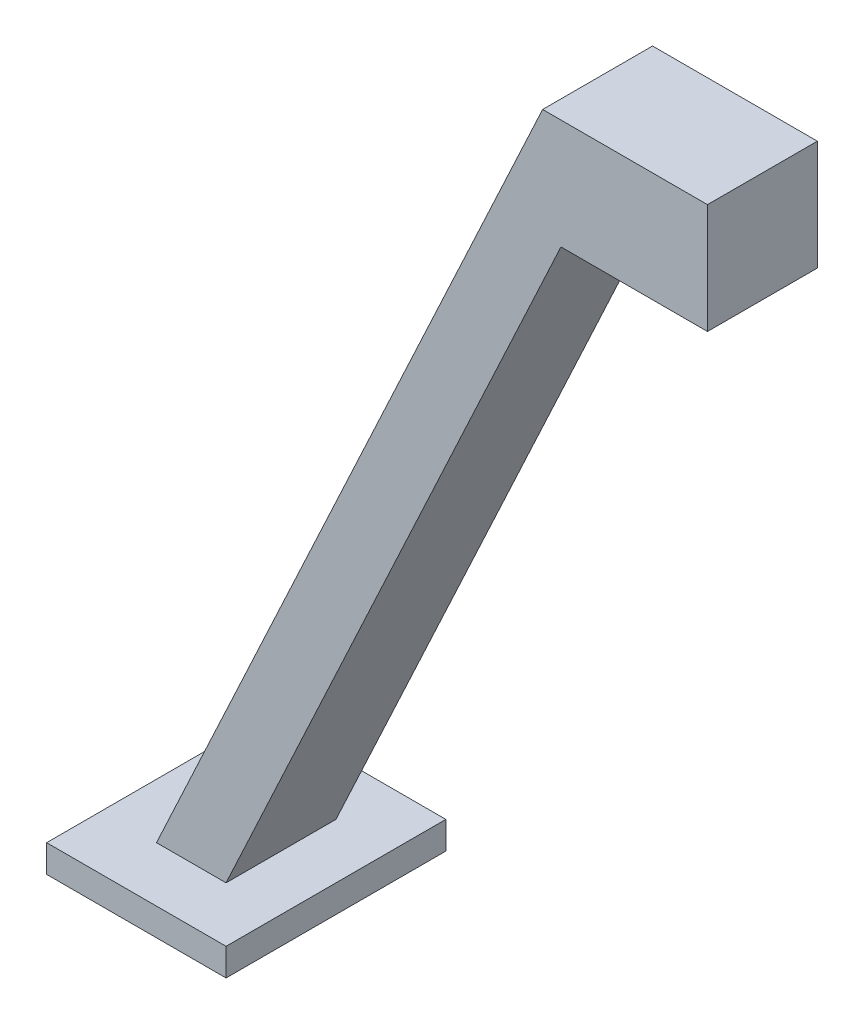
ISO-10303-21;
HEADER;
FILE_DESCRIPTION(('STEP AP214'),'2;1');
FILE_NAME('part.step','',(''),(''),'','','');
FILE_SCHEMA(('AUTOMOTIVE_DESIGN { 1 0 10303 214 1 1 1 1 }'));
ENDSEC;
DATA;
#1=APPLICATION_CONTEXT('core data for automotive mechanical design processes');
#2=APPLICATION_PROTOCOL_DEFINITION('international standard','automotive_design',2000,#1);
#3=PRODUCT_CONTEXT('',#1,'mechanical');
#4=PRODUCT('Part','Part','',(#3));
#5=PRODUCT_RELATED_PRODUCT_CATEGORY('part','',(#4));
#6=PRODUCT_DEFINITION_FORMATION('','',#4);
#7=PRODUCT_DEFINITION_CONTEXT('part definition',#1,'design');
#8=PRODUCT_DEFINITION('design','',#6,#7);
#9=PRODUCT_DEFINITION_SHAPE('','',#8);
#10=(LENGTH_UNIT() NAMED_UNIT(*) SI_UNIT(.MILLI.,.METRE.));
#11=(NAMED_UNIT(*) PLANE_ANGLE_UNIT() SI_UNIT($,.RADIAN.));
#12=(NAMED_UNIT(*) SI_UNIT($,.STERADIAN.) SOLID_ANGLE_UNIT());
#13=UNCERTAINTY_MEASURE_WITH_UNIT(LENGTH_MEASURE(1.E-05),#10,'distance_accuracy_value','');
#14=(GEOMETRIC_REPRESENTATION_CONTEXT(3) GLOBAL_UNCERTAINTY_ASSIGNED_CONTEXT((#13)) GLOBAL_UNIT_ASSIGNED_CONTEXT((#10,
#11,#12)) REPRESENTATION_CONTEXT('',''));
#15=CARTESIAN_POINT('',(0.,0.,0.));
#16=DIRECTION('',(0.,0.,1.));
#17=DIRECTION('',(1.,0.,0.));
#18=AXIS2_PLACEMENT_3D('',#15,#16,#17);
#19=CARTESIAN_POINT('',(-85.2725640839578,-140.7,20.));
#20=DIRECTION('',(0.906307787036651,-0.422618261740697,0.));
#21=DIRECTION('',(0.422618261740697,0.906307787036651,0.));
#22=AXIS2_PLACEMENT_3D('',#19,#20,#21);
#23=PLANE('',#22);
#24=DIRECTION('',(-0.422618261740697,-0.906307787036651,0.));
#25=VECTOR('',#24,1.);
#26=CARTESIAN_POINT('',(-85.2725640839578,-140.7,0.));
#27=LINE('',#26,#25);
#28=CARTESIAN_POINT('',(-15.,10.,0.));
#29=VERTEX_POINT('',#28);
#30=CARTESIAN_POINT('',(-85.2725640839578,-140.7,0.));
#31=VERTEX_POINT('',#30);
#32=EDGE_CURVE('E118',#29,#31,#27,.T.);
#33=ORIENTED_EDGE('',*,*,#32,.T.);
#34=DIRECTION('',(0.,0.,-1.));
#35=VECTOR('',#34,1.);
#36=CARTESIAN_POINT('',(-85.2725640839578,-140.7,20.));
#37=LINE('',#36,#35);
#38=CARTESIAN_POINT('',(-85.2725640839578,-140.7,20.));
#39=VERTEX_POINT('',#38);
#40=EDGE_CURVE('E11',#39,#31,#37,.T.);
#41=ORIENTED_EDGE('',*,*,#40,.F.);
#42=DIRECTION('',(-0.422618261740697,-0.906307787036651,0.));
#43=VECTOR('',#42,1.);
#44=CARTESIAN_POINT('',(-85.2725640839578,-140.7,20.));
#45=LINE('',#44,#43);
#46=CARTESIAN_POINT('',(-15.,10.,20.));
#47=VERTEX_POINT('',#46);
#48=EDGE_CURVE('E84',#47,#39,#45,.T.);
#49=ORIENTED_EDGE('',*,*,#48,.F.);
#50=DIRECTION('',(0.,0.,-1.));
#51=VECTOR('',#50,1.);
#52=CARTESIAN_POINT('',(-15.,10.,20.));
#53=LINE('',#52,#51);
#54=EDGE_CURVE('E114',#47,#29,#53,.T.);
#55=ORIENTED_EDGE('',*,*,#54,.T.);
#56=EDGE_LOOP('',(#33,#41,#49,#55));
#57=FACE_BOUND('',#56,.T.);
#58=ADVANCED_FACE('F35',(#57),#23,.F.);
#59=CARTESIAN_POINT('',(-11.6681995116164,-10.,20.));
#60=DIRECTION('',(-0.906307787036651,0.422618261740697,0.));
#61=DIRECTION('',(-0.422618261740697,-0.906307787036651,0.));
#62=AXIS2_PLACEMENT_3D('',#59,#60,#61);
#63=PLANE('',#62);
#64=DIRECTION('',(0.422618261740697,0.906307787036651,0.));
#65=VECTOR('',#64,1.);
#66=CARTESIAN_POINT('',(-11.6681995116164,-10.,0.));
#67=LINE('',#66,#65);
#68=CARTESIAN_POINT('',(-72.6146104324744,-140.7,0.));
#69=VERTEX_POINT('',#68);
#70=CARTESIAN_POINT('',(-11.6681995116164,-10.,0.));
#71=VERTEX_POINT('',#70);
#72=EDGE_CURVE('E125',#69,#71,#67,.T.);
#73=ORIENTED_EDGE('',*,*,#72,.T.);
#74=DIRECTION('',(0.,0.,-1.));
#75=VECTOR('',#74,1.);
#76=CARTESIAN_POINT('',(-11.6681995116164,-10.,20.));
#77=LINE('',#76,#75);
#78=CARTESIAN_POINT('',(-11.6681995116164,-10.,20.));
#79=VERTEX_POINT('',#78);
#80=EDGE_CURVE('E109',#79,#71,#77,.T.);
#81=ORIENTED_EDGE('',*,*,#80,.F.);
#82=DIRECTION('',(0.422618261740697,0.906307787036651,0.));
#83=VECTOR('',#82,1.);
#84=CARTESIAN_POINT('',(-11.6681995116164,-10.,20.));
#85=LINE('',#84,#83);
#86=CARTESIAN_POINT('',(-72.6146104324744,-140.7,20.));
#87=VERTEX_POINT('',#86);
#88=EDGE_CURVE('E100',#87,#79,#85,.T.);
#89=ORIENTED_EDGE('',*,*,#88,.F.);
#90=DIRECTION('',(0.,0.,-1.));
#91=VECTOR('',#90,1.);
#92=CARTESIAN_POINT('',(-72.6146104324744,-140.7,20.));
#93=LINE('',#92,#91);
#94=EDGE_CURVE('E43',#87,#69,#93,.T.);
#95=ORIENTED_EDGE('',*,*,#94,.T.);
#96=EDGE_LOOP('',(#73,#81,#89,#95));
#97=FACE_BOUND('',#96,.T.);
#98=ADVANCED_FACE('F135',(#97),#63,.F.);
#99=CARTESIAN_POINT('',(15.,-10.,20.));
#100=DIRECTION('',(0.,1.,0.));
#101=DIRECTION('',(-1.,0.,0.));
#102=AXIS2_PLACEMENT_3D('',#99,#100,#101);
#103=PLANE('',#102);
#104=CARTESIAN_POINT('',(4.73695734461899,-10.,9.1808004689824));
#105=DIRECTION('',(0.,-1.,0.));
#106=DIRECTION('',(1.,0.,0.));
#107=AXIS2_PLACEMENT_3D('',#104,#105,#106);
#108=CIRCLE('',#107,2.5);
#109=CARTESIAN_POINT('',(7.23695734461899,-10.,9.1808004689824));
#110=VERTEX_POINT('',#109);
#111=EDGE_CURVE('E169',#110,#110,#108,.T.);
#112=ORIENTED_EDGE('',*,*,#111,.F.);
#113=EDGE_LOOP('',(#112));
#114=FACE_BOUND('',#113,.T.);
#115=DIRECTION('',(1.,0.,0.));
#116=VECTOR('',#115,1.);
#117=CARTESIAN_POINT('',(15.,-10.,0.));
#118=LINE('',#117,#116);
#119=CARTESIAN_POINT('',(15.,-10.,0.));
#120=VERTEX_POINT('',#119);
#121=EDGE_CURVE('E108',#71,#120,#118,.T.);
#122=ORIENTED_EDGE('',*,*,#121,.T.);
#123=DIRECTION('',(0.,0.,-1.));
#124=VECTOR('',#123,1.);
#125=CARTESIAN_POINT('',(15.,-10.,20.));
#126=LINE('',#125,#124);
#127=CARTESIAN_POINT('',(15.,-10.,20.));
#128=VERTEX_POINT('',#127);
#129=EDGE_CURVE('E105',#128,#120,#126,.T.);
#130=ORIENTED_EDGE('',*,*,#129,.F.);
#131=DIRECTION('',(1.,0.,0.));
#132=VECTOR('',#131,1.);
#133=CARTESIAN_POINT('',(15.,-10.,20.));
#134=LINE('',#133,#132);
#135=EDGE_CURVE('E94',#79,#128,#134,.T.);
#136=ORIENTED_EDGE('',*,*,#135,.F.);
#137=ORIENTED_EDGE('',*,*,#80,.T.);
#138=EDGE_LOOP('',(#122,#130,#136,#137));
#139=FACE_BOUND('',#138,.T.);
#140=ADVANCED_FACE('F106',(#114,#139),#103,.F.);
#141=CARTESIAN_POINT('',(15.,-10.,20.));
#142=DIRECTION('',(-1.,0.,0.));
#143=DIRECTION('',(0.,0.,1.));
#144=AXIS2_PLACEMENT_3D('',#141,#142,#143);
#145=PLANE('',#144);
#146=DIRECTION('',(0.,1.,0.));
#147=VECTOR('',#146,1.);
#148=CARTESIAN_POINT('',(15.,-10.,0.));
#149=LINE('',#148,#147);
#150=CARTESIAN_POINT('',(15.,10.,0.));
#151=VERTEX_POINT('',#150);
#152=EDGE_CURVE('E72',#120,#151,#149,.T.);
#153=ORIENTED_EDGE('',*,*,#152,.T.);
#154=DIRECTION('',(0.,0.,-1.));
#155=VECTOR('',#154,1.);
#156=CARTESIAN_POINT('',(15.,10.,20.));
#157=LINE('',#156,#155);
#158=CARTESIAN_POINT('',(15.,10.,20.));
#159=VERTEX_POINT('',#158);
#160=EDGE_CURVE('E110',#159,#151,#157,.T.);
#161=ORIENTED_EDGE('',*,*,#160,.F.);
#162=DIRECTION('',(0.,1.,0.));
#163=VECTOR('',#162,1.);
#164=CARTESIAN_POINT('',(15.,-10.,20.));
#165=LINE('',#164,#163);
#166=EDGE_CURVE('E98',#128,#159,#165,.T.);
#167=ORIENTED_EDGE('',*,*,#166,.F.);
#168=ORIENTED_EDGE('',*,*,#129,.T.);
#169=EDGE_LOOP('',(#153,#161,#167,#168));
#170=FACE_BOUND('',#169,.T.);
#171=ADVANCED_FACE('F112',(#170),#145,.F.);
#172=CARTESIAN_POINT('',(15.,10.,20.));
#173=DIRECTION('',(0.,-1.,0.));
#174=DIRECTION('',(0.,0.,-1.));
#175=AXIS2_PLACEMENT_3D('',#172,#173,#174);
#176=PLANE('',#175);
#177=DIRECTION('',(-1.,0.,0.));
#178=VECTOR('',#177,1.);
#179=CARTESIAN_POINT('',(15.,10.,0.));
#180=LINE('',#179,#178);
#181=EDGE_CURVE('E78',#151,#29,#180,.T.);
#182=ORIENTED_EDGE('',*,*,#181,.T.);
#183=ORIENTED_EDGE('',*,*,#54,.F.);
#184=DIRECTION('',(-1.,0.,0.));
#185=VECTOR('',#184,1.);
#186=CARTESIAN_POINT('',(15.,10.,20.));
#187=LINE('',#186,#185);
#188=EDGE_CURVE('E51',#159,#47,#187,.T.);
#189=ORIENTED_EDGE('',*,*,#188,.F.);
#190=ORIENTED_EDGE('',*,*,#160,.T.);
#191=EDGE_LOOP('',(#182,#183,#189,#190));
#192=FACE_BOUND('',#191,.T.);
#193=ADVANCED_FACE('F146',(#192),#176,.F.);
#194=CARTESIAN_POINT('',(0.,0.,20.));
#195=DIRECTION('',(0.,0.,1.));
#196=DIRECTION('',(1.,0.,0.));
#197=AXIS2_PLACEMENT_3D('',#194,#195,#196);
#198=PLANE('',#197);
#199=ORIENTED_EDGE('',*,*,#48,.T.);
#200=DIRECTION('',(1.,0.,0.));
#201=VECTOR('',#200,1.);
#202=CARTESIAN_POINT('',(-72.6146104324744,-140.7,20.));
#203=LINE('',#202,#201);
#204=EDGE_CURVE('E143',#39,#87,#203,.T.);
#205=ORIENTED_EDGE('',*,*,#204,.T.);
#206=ORIENTED_EDGE('',*,*,#88,.T.);
#207=ORIENTED_EDGE('',*,*,#135,.T.);
#208=ORIENTED_EDGE('',*,*,#166,.T.);
#209=ORIENTED_EDGE('',*,*,#188,.T.);
#210=EDGE_LOOP('',(#199,#205,#206,#207,#208,#209));
#211=FACE_BOUND('',#210,.T.);
#212=ADVANCED_FACE('F96',(#211),#198,.T.);
#213=CARTESIAN_POINT('',(0.,0.,0.));
#214=DIRECTION('',(0.,0.,1.));
#215=DIRECTION('',(1.,0.,0.));
#216=AXIS2_PLACEMENT_3D('',#213,#214,#215);
#217=PLANE('',#216);
#218=ORIENTED_EDGE('',*,*,#32,.F.);
#219=ORIENTED_EDGE('',*,*,#181,.F.);
#220=ORIENTED_EDGE('',*,*,#152,.F.);
#221=ORIENTED_EDGE('',*,*,#121,.F.);
#222=ORIENTED_EDGE('',*,*,#72,.F.);
#223=DIRECTION('',(1.,0.,0.));
#224=VECTOR('',#223,1.);
#225=CARTESIAN_POINT('',(-72.6146104324744,-140.7,0.));
#226=LINE('',#225,#224);
#227=EDGE_CURVE('E121',#31,#69,#226,.T.);
#228=ORIENTED_EDGE('',*,*,#227,.F.);
#229=EDGE_LOOP('',(#218,#219,#220,#221,#222,#228));
#230=FACE_BOUND('',#229,.T.);
#231=ADVANCED_FACE('F141',(#230),#217,.F.);
#232=CARTESIAN_POINT('',(0.,-140.7,0.));
#233=DIRECTION('',(0.,-1.,0.));
#234=DIRECTION('',(0.,0.,-1.));
#235=AXIS2_PLACEMENT_3D('',#232,#233,#234);
#236=PLANE('',#235);
#237=DIRECTION('',(0.,0.,-1.));
#238=VECTOR('',#237,1.);
#239=CARTESIAN_POINT('',(-95.2725640839578,-140.7,30.));
#240=LINE('',#239,#238);
#241=CARTESIAN_POINT('',(-95.2725640839578,-140.7,30.));
#242=VERTEX_POINT('',#241);
#243=CARTESIAN_POINT('',(-95.2725640839578,-140.7,-10.));
#244=VERTEX_POINT('',#243);
#245=EDGE_CURVE('E174',#242,#244,#240,.T.);
#246=ORIENTED_EDGE('',*,*,#245,.F.);
#247=DIRECTION('',(-1.,0.,0.));
#248=VECTOR('',#247,1.);
#249=CARTESIAN_POINT('',(-62.6146104324744,-140.7,30.));
#250=LINE('',#249,#248);
#251=CARTESIAN_POINT('',(-62.6146104324744,-140.7,30.));
#252=VERTEX_POINT('',#251);
#253=EDGE_CURVE('E181',#252,#242,#250,.T.);
#254=ORIENTED_EDGE('',*,*,#253,.F.);
#255=DIRECTION('',(0.,0.,1.));
#256=VECTOR('',#255,1.);
#257=CARTESIAN_POINT('',(-62.6146104324744,-140.7,-10.));
#258=LINE('',#257,#256);
#259=CARTESIAN_POINT('',(-62.6146104324744,-140.7,-10.));
#260=VERTEX_POINT('',#259);
#261=EDGE_CURVE('E196',#260,#252,#258,.T.);
#262=ORIENTED_EDGE('',*,*,#261,.F.);
#263=DIRECTION('',(1.,0.,0.));
#264=VECTOR('',#263,1.);
#265=CARTESIAN_POINT('',(-95.2725640839578,-140.7,-10.));
#266=LINE('',#265,#264);
#267=EDGE_CURVE('E193',#244,#260,#266,.T.);
#268=ORIENTED_EDGE('',*,*,#267,.F.);
#269=EDGE_LOOP('',(#246,#254,#262,#268));
#270=FACE_BOUND('',#269,.T.);
#271=ORIENTED_EDGE('',*,*,#40,.T.);
#272=ORIENTED_EDGE('',*,*,#227,.T.);
#273=ORIENTED_EDGE('',*,*,#94,.F.);
#274=ORIENTED_EDGE('',*,*,#204,.F.);
#275=EDGE_LOOP('',(#271,#272,#273,#274));
#276=FACE_BOUND('',#275,.T.);
#277=ADVANCED_FACE('F142',(#270,#276),#236,.F.);
#278=CARTESIAN_POINT('',(-95.2725640839578,-145.7,30.));
#279=DIRECTION('',(1.,0.,0.));
#280=DIRECTION('',(0.,0.,-1.));
#281=AXIS2_PLACEMENT_3D('',#278,#279,#280);
#282=PLANE('',#281);
#283=ORIENTED_EDGE('',*,*,#245,.T.);
#284=DIRECTION('',(0.,1.,0.));
#285=VECTOR('',#284,1.);
#286=CARTESIAN_POINT('',(-95.2725640839578,-145.7,-10.));
#287=LINE('',#286,#285);
#288=CARTESIAN_POINT('',(-95.2725640839578,-145.7,-10.));
#289=VERTEX_POINT('',#288);
#290=EDGE_CURVE('E122',#289,#244,#287,.T.);
#291=ORIENTED_EDGE('',*,*,#290,.F.);
#292=DIRECTION('',(0.,0.,-1.));
#293=VECTOR('',#292,1.);
#294=CARTESIAN_POINT('',(-95.2725640839578,-145.7,30.));
#295=LINE('',#294,#293);
#296=CARTESIAN_POINT('',(-95.2725640839578,-145.7,30.));
#297=VERTEX_POINT('',#296);
#298=EDGE_CURVE('E177',#297,#289,#295,.T.);
#299=ORIENTED_EDGE('',*,*,#298,.F.);
#300=DIRECTION('',(0.,1.,0.));
#301=VECTOR('',#300,1.);
#302=CARTESIAN_POINT('',(-95.2725640839578,-145.7,30.));
#303=LINE('',#302,#301);
#304=EDGE_CURVE('E190',#297,#242,#303,.T.);
#305=ORIENTED_EDGE('',*,*,#304,.T.);
#306=EDGE_LOOP('',(#283,#291,#299,#305));
#307=FACE_BOUND('',#306,.T.);
#308=ADVANCED_FACE('F225',(#307),#282,.F.);
#309=CARTESIAN_POINT('',(-95.2725640839578,-145.7,-10.));
#310=DIRECTION('',(0.,0.,1.));
#311=DIRECTION('',(1.,0.,0.));
#312=AXIS2_PLACEMENT_3D('',#309,#310,#311);
#313=PLANE('',#312);
#314=ORIENTED_EDGE('',*,*,#267,.T.);
#315=DIRECTION('',(0.,1.,0.));
#316=VECTOR('',#315,1.);
#317=CARTESIAN_POINT('',(-62.6146104324744,-145.7,-10.));
#318=LINE('',#317,#316);
#319=CARTESIAN_POINT('',(-62.6146104324744,-145.7,-10.));
#320=VERTEX_POINT('',#319);
#321=EDGE_CURVE('E206',#320,#260,#318,.T.);
#322=ORIENTED_EDGE('',*,*,#321,.F.);
#323=DIRECTION('',(1.,0.,0.));
#324=VECTOR('',#323,1.);
#325=CARTESIAN_POINT('',(-95.2725640839578,-145.7,-10.));
#326=LINE('',#325,#324);
#327=EDGE_CURVE('E180',#289,#320,#326,.T.);
#328=ORIENTED_EDGE('',*,*,#327,.F.);
#329=ORIENTED_EDGE('',*,*,#290,.T.);
#330=EDGE_LOOP('',(#314,#322,#328,#329));
#331=FACE_BOUND('',#330,.T.);
#332=ADVANCED_FACE('F216',(#331),#313,.F.);
#333=CARTESIAN_POINT('',(-62.6146104324744,-145.7,-10.));
#334=DIRECTION('',(-1.,0.,0.));
#335=DIRECTION('',(0.,0.,1.));
#336=AXIS2_PLACEMENT_3D('',#333,#334,#335);
#337=PLANE('',#336);
#338=ORIENTED_EDGE('',*,*,#261,.T.);
#339=DIRECTION('',(0.,1.,0.));
#340=VECTOR('',#339,1.);
#341=CARTESIAN_POINT('',(-62.6146104324744,-145.7,30.));
#342=LINE('',#341,#340);
#343=CARTESIAN_POINT('',(-62.6146104324744,-145.7,30.));
#344=VERTEX_POINT('',#343);
#345=EDGE_CURVE('E203',#344,#252,#342,.T.);
#346=ORIENTED_EDGE('',*,*,#345,.F.);
#347=DIRECTION('',(0.,0.,1.));
#348=VECTOR('',#347,1.);
#349=CARTESIAN_POINT('',(-62.6146104324744,-145.7,-10.));
#350=LINE('',#349,#348);
#351=EDGE_CURVE('E184',#320,#344,#350,.T.);
#352=ORIENTED_EDGE('',*,*,#351,.F.);
#353=ORIENTED_EDGE('',*,*,#321,.T.);
#354=EDGE_LOOP('',(#338,#346,#352,#353));
#355=FACE_BOUND('',#354,.T.);
#356=ADVANCED_FACE('F246',(#355),#337,.F.);
#357=CARTESIAN_POINT('',(-62.6146104324744,-145.7,30.));
#358=DIRECTION('',(0.,0.,-1.));
#359=DIRECTION('',(-1.,0.,0.));
#360=AXIS2_PLACEMENT_3D('',#357,#358,#359);
#361=PLANE('',#360);
#362=ORIENTED_EDGE('',*,*,#253,.T.);
#363=ORIENTED_EDGE('',*,*,#304,.F.);
#364=DIRECTION('',(-1.,0.,0.));
#365=VECTOR('',#364,1.);
#366=CARTESIAN_POINT('',(-62.6146104324744,-145.7,30.));
#367=LINE('',#366,#365);
#368=EDGE_CURVE('E187',#344,#297,#367,.T.);
#369=ORIENTED_EDGE('',*,*,#368,.F.);
#370=ORIENTED_EDGE('',*,*,#345,.T.);
#371=EDGE_LOOP('',(#362,#363,#369,#370));
#372=FACE_BOUND('',#371,.T.);
#373=ADVANCED_FACE('F248',(#372),#361,.F.);
#374=CARTESIAN_POINT('',(0.,-145.7,0.));
#375=DIRECTION('',(0.,-1.,0.));
#376=DIRECTION('',(0.,0.,-1.));
#377=AXIS2_PLACEMENT_3D('',#374,#375,#376);
#378=PLANE('',#377);
#379=ORIENTED_EDGE('',*,*,#298,.T.);
#380=ORIENTED_EDGE('',*,*,#327,.T.);
#381=ORIENTED_EDGE('',*,*,#351,.T.);
#382=ORIENTED_EDGE('',*,*,#368,.T.);
#383=EDGE_LOOP('',(#379,#380,#381,#382));
#384=FACE_BOUND('',#383,.T.);
#385=ADVANCED_FACE('F242',(#384),#378,.T.);
#386=CARTESIAN_POINT('',(4.73695734461899,-9.,9.1808004689824));
#387=DIRECTION('',(0.,-1.,0.));
#388=DIRECTION('',(1.,0.,0.));
#389=AXIS2_PLACEMENT_3D('',#386,#387,#388);
#390=CYLINDRICAL_SURFACE('',#389,2.5);
#391=CARTESIAN_POINT('',(4.73695734461899,-9.,9.1808004689824));
#392=DIRECTION('',(0.,-1.,0.));
#393=DIRECTION('',(1.,0.,0.));
#394=AXIS2_PLACEMENT_3D('',#391,#392,#393);
#395=CIRCLE('',#394,2.5);
#396=CARTESIAN_POINT('',(7.23695734461899,-9.,9.1808004689824));
#397=VERTEX_POINT('',#396);
#398=EDGE_CURVE('E171',#397,#397,#395,.T.);
#399=ORIENTED_EDGE('',*,*,#398,.F.);
#400=EDGE_LOOP('',(#399));
#401=FACE_BOUND('',#400,.T.);
#402=ORIENTED_EDGE('',*,*,#111,.T.);
#403=EDGE_LOOP('',(#402));
#404=FACE_BOUND('',#403,.T.);
#405=ADVANCED_FACE('F255',(#401,#404),#390,.F.);
#406=CARTESIAN_POINT('',(4.73695734461899,-9.,9.1808004689824));
#407=DIRECTION('',(0.,-1.,0.));
#408=DIRECTION('',(1.,0.,0.));
#409=AXIS2_PLACEMENT_3D('',#406,#407,#408);
#410=PLANE('',#409);
#411=ORIENTED_EDGE('',*,*,#398,.T.);
#412=EDGE_LOOP('',(#411));
#413=FACE_BOUND('',#412,.T.);
#414=ADVANCED_FACE('F310',(#413),#410,.T.);
#415=CLOSED_SHELL('',(#58,#98,#140,#171,#193,#212,#231,#277,#308,#332,#356,#373,#385,#405,#414));
#416=MANIFOLD_SOLID_BREP('B2',#415);
#417=ADVANCED_BREP_SHAPE_REPRESENTATION('',(#18,#416),#14);
#418=SHAPE_DEFINITION_REPRESENTATION(#9,#417);
ENDSEC;
END-ISO-10303-21;
